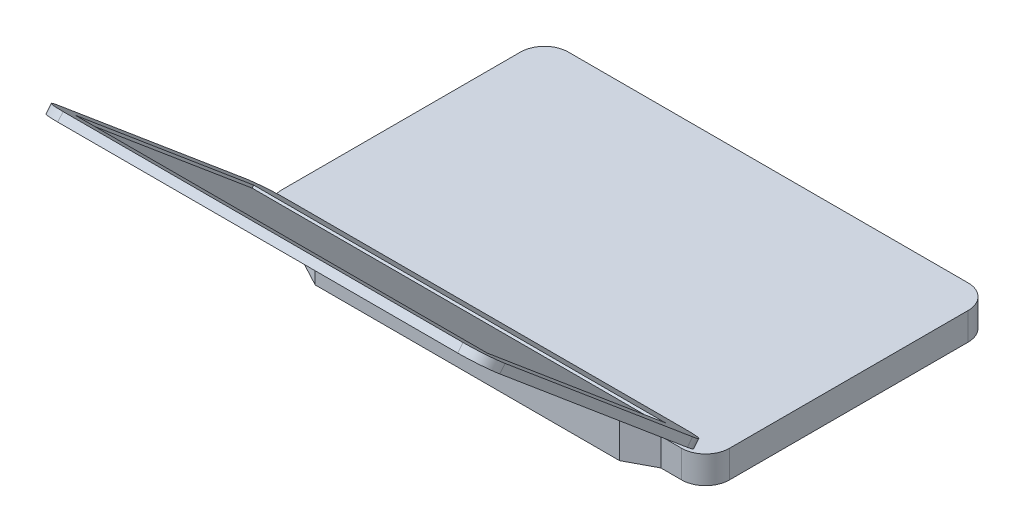
ISO-10303-21;
HEADER;
FILE_DESCRIPTION(('STEP AP214'),'2;1');
FILE_NAME('part.step','',(''),(''),'','','');
FILE_SCHEMA(('AUTOMOTIVE_DESIGN { 1 0 10303 214 1 1 1 1 }'));
ENDSEC;
DATA;
#1=APPLICATION_CONTEXT('core data for automotive mechanical design processes');
#2=APPLICATION_PROTOCOL_DEFINITION('international standard','automotive_design',2000,#1);
#3=PRODUCT_CONTEXT('',#1,'mechanical');
#4=PRODUCT('Part','Part','',(#3));
#5=PRODUCT_RELATED_PRODUCT_CATEGORY('part','',(#4));
#6=PRODUCT_DEFINITION_FORMATION('','',#4);
#7=PRODUCT_DEFINITION_CONTEXT('part definition',#1,'design');
#8=PRODUCT_DEFINITION('design','',#6,#7);
#9=PRODUCT_DEFINITION_SHAPE('','',#8);
#10=(LENGTH_UNIT() NAMED_UNIT(*) SI_UNIT(.MILLI.,.METRE.));
#11=(NAMED_UNIT(*) PLANE_ANGLE_UNIT() SI_UNIT($,.RADIAN.));
#12=(NAMED_UNIT(*) SI_UNIT($,.STERADIAN.) SOLID_ANGLE_UNIT());
#13=UNCERTAINTY_MEASURE_WITH_UNIT(LENGTH_MEASURE(1.E-05),#10,'distance_accuracy_value','');
#14=(GEOMETRIC_REPRESENTATION_CONTEXT(3) GLOBAL_UNCERTAINTY_ASSIGNED_CONTEXT((#13)) GLOBAL_UNIT_ASSIGNED_CONTEXT((#10,
#11,#12)) REPRESENTATION_CONTEXT('',''));
#15=CARTESIAN_POINT('',(0.,0.,0.));
#16=DIRECTION('',(0.,0.,1.));
#17=DIRECTION('',(1.,0.,0.));
#18=AXIS2_PLACEMENT_3D('',#15,#16,#17);
#19=CARTESIAN_POINT('',(187.5,23.,120.));
#20=DIRECTION('',(0.,0.,-1.));
#21=DIRECTION('',(-1.,0.,0.));
#22=AXIS2_PLACEMENT_3D('',#19,#20,#21);
#23=PLANE('',#22);
#24=DIRECTION('',(1.,0.,0.));
#25=VECTOR('',#24,1.);
#26=CARTESIAN_POINT('',(187.5,23.,120.));
#27=LINE('',#26,#25);
#28=CARTESIAN_POINT('',(-167.5,23.,120.));
#29=VERTEX_POINT('',#28);
#30=CARTESIAN_POINT('',(-150.,23.,120.));
#31=VERTEX_POINT('',#30);
#32=EDGE_CURVE('E318',#29,#31,#27,.T.);
#33=ORIENTED_EDGE('',*,*,#32,.F.);
#34=DIRECTION('',(0.,-1.,0.));
#35=VECTOR('',#34,1.);
#36=CARTESIAN_POINT('',(-167.5,23.,120.));
#37=LINE('',#36,#35);
#38=CARTESIAN_POINT('',(-167.5,0.,120.));
#39=VERTEX_POINT('',#38);
#40=EDGE_CURVE('E397',#29,#39,#37,.T.);
#41=ORIENTED_EDGE('',*,*,#40,.T.);
#42=DIRECTION('',(1.,0.,0.));
#43=VECTOR('',#42,1.);
#44=CARTESIAN_POINT('',(187.5,0.,120.));
#45=LINE('',#44,#43);
#46=CARTESIAN_POINT('',(-150.,0.,120.));
#47=VERTEX_POINT('',#46);
#48=EDGE_CURVE('E330',#39,#47,#45,.T.);
#49=ORIENTED_EDGE('',*,*,#48,.T.);
#50=DIRECTION('',(0.,-1.,0.));
#51=VECTOR('',#50,1.);
#52=CARTESIAN_POINT('',(-150.,34.,120.));
#53=LINE('',#52,#51);
#54=EDGE_CURVE('E307',#31,#47,#53,.T.);
#55=ORIENTED_EDGE('',*,*,#54,.F.);
#56=EDGE_LOOP('',(#33,#41,#49,#55));
#57=FACE_BOUND('',#56,.T.);
#58=ADVANCED_FACE('F38',(#57),#23,.F.);
#59=CARTESIAN_POINT('',(-187.5,23.,120.));
#60=DIRECTION('',(1.,0.,0.));
#61=DIRECTION('',(0.,0.,-1.));
#62=AXIS2_PLACEMENT_3D('',#59,#60,#61);
#63=PLANE('',#62);
#64=DIRECTION('',(0.,0.,1.));
#65=VECTOR('',#64,1.);
#66=CARTESIAN_POINT('',(-187.5,23.,120.));
#67=LINE('',#66,#65);
#68=CARTESIAN_POINT('',(-187.5,23.,-100.));
#69=VERTEX_POINT('',#68);
#70=CARTESIAN_POINT('',(-187.5,23.,100.));
#71=VERTEX_POINT('',#70);
#72=EDGE_CURVE('E313',#69,#71,#67,.T.);
#73=ORIENTED_EDGE('',*,*,#72,.F.);
#74=DIRECTION('',(0.,-1.,0.));
#75=VECTOR('',#74,1.);
#76=CARTESIAN_POINT('',(-187.5,23.,-100.));
#77=LINE('',#76,#75);
#78=CARTESIAN_POINT('',(-187.5,0.,-100.));
#79=VERTEX_POINT('',#78);
#80=EDGE_CURVE('E341',#69,#79,#77,.T.);
#81=ORIENTED_EDGE('',*,*,#80,.T.);
#82=DIRECTION('',(0.,0.,1.));
#83=VECTOR('',#82,1.);
#84=CARTESIAN_POINT('',(-187.5,0.,120.));
#85=LINE('',#84,#83);
#86=CARTESIAN_POINT('',(-187.5,0.,100.));
#87=VERTEX_POINT('',#86);
#88=EDGE_CURVE('E305',#79,#87,#85,.T.);
#89=ORIENTED_EDGE('',*,*,#88,.T.);
#90=DIRECTION('',(0.,-1.,0.));
#91=VECTOR('',#90,1.);
#92=CARTESIAN_POINT('',(-187.5,23.,100.));
#93=LINE('',#92,#91);
#94=EDGE_CURVE('E339',#87,#71,#93,.F.);
#95=ORIENTED_EDGE('',*,*,#94,.T.);
#96=EDGE_LOOP('',(#73,#81,#89,#95));
#97=FACE_BOUND('',#96,.T.);
#98=ADVANCED_FACE('F451',(#97),#63,.F.);
#99=CARTESIAN_POINT('',(150.,0.,120.));
#100=VERTEX_POINT('',#99);
#101=CARTESIAN_POINT('',(167.5,0.,120.));
#102=VERTEX_POINT('',#101);
#103=EDGE_CURVE('E329',#100,#102,#45,.T.);
#104=ORIENTED_EDGE('',*,*,#103,.T.);
#105=DIRECTION('',(0.,-1.,0.));
#106=VECTOR('',#105,1.);
#107=CARTESIAN_POINT('',(167.5,23.,120.));
#108=LINE('',#107,#106);
#109=CARTESIAN_POINT('',(167.5,23.,120.));
#110=VERTEX_POINT('',#109);
#111=EDGE_CURVE('E370',#102,#110,#108,.F.);
#112=ORIENTED_EDGE('',*,*,#111,.T.);
#113=CARTESIAN_POINT('',(150.,23.,120.));
#114=VERTEX_POINT('',#113);
#115=EDGE_CURVE('E316',#114,#110,#27,.T.);
#116=ORIENTED_EDGE('',*,*,#115,.F.);
#117=DIRECTION('',(0.,-1.,0.));
#118=VECTOR('',#117,1.);
#119=CARTESIAN_POINT('',(150.,34.,120.));
#120=LINE('',#119,#118);
#121=EDGE_CURVE('E312',#114,#100,#120,.T.);
#122=ORIENTED_EDGE('',*,*,#121,.T.);
#123=EDGE_LOOP('',(#104,#112,#116,#122));
#124=FACE_BOUND('',#123,.T.);
#125=ADVANCED_FACE('F454',(#124),#23,.F.);
#126=CARTESIAN_POINT('',(187.5,23.,120.));
#127=DIRECTION('',(-1.,0.,0.));
#128=DIRECTION('',(0.,0.,1.));
#129=AXIS2_PLACEMENT_3D('',#126,#127,#128);
#130=PLANE('',#129);
#131=DIRECTION('',(0.,0.,-1.));
#132=VECTOR('',#131,1.);
#133=CARTESIAN_POINT('',(187.5,0.,120.));
#134=LINE('',#133,#132);
#135=CARTESIAN_POINT('',(187.5,0.,99.9999999999999));
#136=VERTEX_POINT('',#135);
#137=CARTESIAN_POINT('',(187.5,0.,-100.));
#138=VERTEX_POINT('',#137);
#139=EDGE_CURVE('E332',#136,#138,#134,.T.);
#140=ORIENTED_EDGE('',*,*,#139,.T.);
#141=DIRECTION('',(0.,-1.,0.));
#142=VECTOR('',#141,1.);
#143=CARTESIAN_POINT('',(187.5,23.,-100.));
#144=LINE('',#143,#142);
#145=CARTESIAN_POINT('',(187.5,23.,-100.));
#146=VERTEX_POINT('',#145);
#147=EDGE_CURVE('E368',#138,#146,#144,.F.);
#148=ORIENTED_EDGE('',*,*,#147,.T.);
#149=DIRECTION('',(0.,0.,-1.));
#150=VECTOR('',#149,1.);
#151=CARTESIAN_POINT('',(187.5,23.,120.));
#152=LINE('',#151,#150);
#153=CARTESIAN_POINT('',(187.5,23.,99.9999999999999));
#154=VERTEX_POINT('',#153);
#155=EDGE_CURVE('E320',#154,#146,#152,.T.);
#156=ORIENTED_EDGE('',*,*,#155,.F.);
#157=DIRECTION('',(0.,-1.,0.));
#158=VECTOR('',#157,1.);
#159=CARTESIAN_POINT('',(187.5,23.,99.9999999999999));
#160=LINE('',#159,#158);
#161=EDGE_CURVE('E365',#154,#136,#160,.T.);
#162=ORIENTED_EDGE('',*,*,#161,.T.);
#163=EDGE_LOOP('',(#140,#148,#156,#162));
#164=FACE_BOUND('',#163,.T.);
#165=ADVANCED_FACE('F463',(#164),#130,.F.);
#166=CARTESIAN_POINT('',(187.5,23.,-120.));
#167=DIRECTION('',(0.,0.,1.));
#168=DIRECTION('',(1.,0.,0.));
#169=AXIS2_PLACEMENT_3D('',#166,#167,#168);
#170=PLANE('',#169);
#171=DIRECTION('',(-1.,0.,0.));
#172=VECTOR('',#171,1.);
#173=CARTESIAN_POINT('',(187.5,0.,-120.));
#174=LINE('',#173,#172);
#175=CARTESIAN_POINT('',(167.5,0.,-120.));
#176=VERTEX_POINT('',#175);
#177=CARTESIAN_POINT('',(-167.5,0.,-120.));
#178=VERTEX_POINT('',#177);
#179=EDGE_CURVE('E317',#176,#178,#174,.T.);
#180=ORIENTED_EDGE('',*,*,#179,.T.);
#181=DIRECTION('',(0.,-1.,0.));
#182=VECTOR('',#181,1.);
#183=CARTESIAN_POINT('',(-167.5,23.,-120.));
#184=LINE('',#183,#182);
#185=CARTESIAN_POINT('',(-167.5,23.,-120.));
#186=VERTEX_POINT('',#185);
#187=EDGE_CURVE('E355',#178,#186,#184,.F.);
#188=ORIENTED_EDGE('',*,*,#187,.T.);
#189=DIRECTION('',(-1.,0.,0.));
#190=VECTOR('',#189,1.);
#191=CARTESIAN_POINT('',(187.5,23.,-120.));
#192=LINE('',#191,#190);
#193=CARTESIAN_POINT('',(167.5,23.,-120.));
#194=VERTEX_POINT('',#193);
#195=EDGE_CURVE('E324',#194,#186,#192,.T.);
#196=ORIENTED_EDGE('',*,*,#195,.F.);
#197=DIRECTION('',(0.,-1.,0.));
#198=VECTOR('',#197,1.);
#199=CARTESIAN_POINT('',(167.5,23.,-120.));
#200=LINE('',#199,#198);
#201=EDGE_CURVE('E352',#194,#176,#200,.T.);
#202=ORIENTED_EDGE('',*,*,#201,.T.);
#203=EDGE_LOOP('',(#180,#188,#196,#202));
#204=FACE_BOUND('',#203,.T.);
#205=ADVANCED_FACE('F468',(#204),#170,.F.);
#206=CARTESIAN_POINT('',(0.,23.,0.));
#207=DIRECTION('',(0.,1.,0.));
#208=DIRECTION('',(0.,0.,1.));
#209=AXIS2_PLACEMENT_3D('',#206,#207,#208);
#210=PLANE('',#209);
#211=ORIENTED_EDGE('',*,*,#195,.T.);
#212=CARTESIAN_POINT('',(-167.5,23.,-100.));
#213=DIRECTION('',(0.,1.,0.));
#214=DIRECTION('',(0.,0.,1.));
#215=AXIS2_PLACEMENT_3D('',#212,#213,#214);
#216=CIRCLE('',#215,20.);
#217=EDGE_CURVE('E363',#186,#69,#216,.T.);
#218=ORIENTED_EDGE('',*,*,#217,.T.);
#219=ORIENTED_EDGE('',*,*,#72,.T.);
#220=CARTESIAN_POINT('',(-167.5,23.,100.));
#221=DIRECTION('',(0.,1.,0.));
#222=DIRECTION('',(0.,0.,1.));
#223=AXIS2_PLACEMENT_3D('',#220,#221,#222);
#224=CIRCLE('',#223,20.);
#225=EDGE_CURVE('E357',#71,#29,#224,.T.);
#226=ORIENTED_EDGE('',*,*,#225,.T.);
#227=ORIENTED_EDGE('',*,*,#32,.T.);
#228=EDGE_CURVE('E321',#31,#114,#27,.T.);
#229=ORIENTED_EDGE('',*,*,#228,.T.);
#230=ORIENTED_EDGE('',*,*,#115,.T.);
#231=CARTESIAN_POINT('',(167.5,23.,99.9999999999999));
#232=DIRECTION('',(0.,1.,0.));
#233=DIRECTION('',(0.,0.,1.));
#234=AXIS2_PLACEMENT_3D('',#231,#232,#233);
#235=CIRCLE('',#234,20.);
#236=EDGE_CURVE('E359',#110,#154,#235,.T.);
#237=ORIENTED_EDGE('',*,*,#236,.T.);
#238=ORIENTED_EDGE('',*,*,#155,.T.);
#239=CARTESIAN_POINT('',(167.5,23.,-100.));
#240=DIRECTION('',(0.,1.,0.));
#241=DIRECTION('',(0.,0.,1.));
#242=AXIS2_PLACEMENT_3D('',#239,#240,#241);
#243=CIRCLE('',#242,20.);
#244=EDGE_CURVE('E361',#146,#194,#243,.T.);
#245=ORIENTED_EDGE('',*,*,#244,.T.);
#246=EDGE_LOOP('',(#211,#218,#219,#226,#227,#229,#230,#237,#238,#245));
#247=FACE_BOUND('',#246,.T.);
#248=ADVANCED_FACE('F484',(#247),#210,.T.);
#249=CARTESIAN_POINT('',(0.,0.,0.));
#250=DIRECTION('',(0.,1.,0.));
#251=DIRECTION('',(0.,0.,1.));
#252=AXIS2_PLACEMENT_3D('',#249,#250,#251);
#253=PLANE('',#252);
#254=ORIENTED_EDGE('',*,*,#88,.F.);
#255=CARTESIAN_POINT('',(-167.5,0.,-100.));
#256=DIRECTION('',(0.,1.,0.));
#257=DIRECTION('',(0.,0.,1.));
#258=AXIS2_PLACEMENT_3D('',#255,#256,#257);
#259=CIRCLE('',#258,20.);
#260=EDGE_CURVE('E350',#79,#178,#259,.F.);
#261=ORIENTED_EDGE('',*,*,#260,.T.);
#262=ORIENTED_EDGE('',*,*,#179,.F.);
#263=CARTESIAN_POINT('',(167.5,0.,-100.));
#264=DIRECTION('',(0.,1.,0.));
#265=DIRECTION('',(0.,0.,1.));
#266=AXIS2_PLACEMENT_3D('',#263,#264,#265);
#267=CIRCLE('',#266,20.);
#268=EDGE_CURVE('E348',#176,#138,#267,.F.);
#269=ORIENTED_EDGE('',*,*,#268,.T.);
#270=ORIENTED_EDGE('',*,*,#139,.F.);
#271=CARTESIAN_POINT('',(167.5,0.,99.9999999999999));
#272=DIRECTION('',(0.,1.,0.));
#273=DIRECTION('',(0.,0.,1.));
#274=AXIS2_PLACEMENT_3D('',#271,#272,#273);
#275=CIRCLE('',#274,20.);
#276=EDGE_CURVE('E346',#136,#102,#275,.F.);
#277=ORIENTED_EDGE('',*,*,#276,.T.);
#278=ORIENTED_EDGE('',*,*,#103,.F.);
#279=DIRECTION('',(-0.88235294117647,0.,0.470588235294118));
#280=VECTOR('',#279,1.);
#281=CARTESIAN_POINT('',(150.,0.,120.));
#282=LINE('',#281,#280);
#283=CARTESIAN_POINT('',(127.5,0.,132.));
#284=VERTEX_POINT('',#283);
#285=EDGE_CURVE('E284',#100,#284,#282,.T.);
#286=ORIENTED_EDGE('',*,*,#285,.T.);
#287=DIRECTION('',(-1.,0.,0.));
#288=VECTOR('',#287,1.);
#289=CARTESIAN_POINT('',(-127.5,0.,132.));
#290=LINE('',#289,#288);
#291=CARTESIAN_POINT('',(-127.5,0.,132.));
#292=VERTEX_POINT('',#291);
#293=EDGE_CURVE('E297',#284,#292,#290,.T.);
#294=ORIENTED_EDGE('',*,*,#293,.T.);
#295=DIRECTION('',(-0.88235294117647,0.,-0.470588235294118));
#296=VECTOR('',#295,1.);
#297=CARTESIAN_POINT('',(-150.,0.,120.));
#298=LINE('',#297,#296);
#299=EDGE_CURVE('E288',#292,#47,#298,.T.);
#300=ORIENTED_EDGE('',*,*,#299,.T.);
#301=ORIENTED_EDGE('',*,*,#48,.F.);
#302=CARTESIAN_POINT('',(-167.5,0.,100.));
#303=DIRECTION('',(0.,1.,0.));
#304=DIRECTION('',(0.,0.,1.));
#305=AXIS2_PLACEMENT_3D('',#302,#303,#304);
#306=CIRCLE('',#305,20.);
#307=EDGE_CURVE('E344',#39,#87,#306,.F.);
#308=ORIENTED_EDGE('',*,*,#307,.T.);
#309=EDGE_LOOP('',(#254,#261,#262,#269,#270,#277,#278,#286,#294,#300,#301,#308));
#310=FACE_BOUND('',#309,.T.);
#311=ADVANCED_FACE('F513',(#310),#253,.F.);
#312=CARTESIAN_POINT('',(-150.,34.,120.));
#313=DIRECTION('',(0.,0.,-1.));
#314=DIRECTION('',(-1.,0.,0.));
#315=AXIS2_PLACEMENT_3D('',#312,#313,#314);
#316=PLANE('',#315);
#317=DIRECTION('',(-1.,0.,0.));
#318=VECTOR('',#317,1.);
#319=CARTESIAN_POINT('',(187.5,28.5,120.));
#320=LINE('',#319,#318);
#321=CARTESIAN_POINT('',(150.,28.5,120.));
#322=VERTEX_POINT('',#321);
#323=CARTESIAN_POINT('',(-150.,28.5,120.));
#324=VERTEX_POINT('',#323);
#325=EDGE_CURVE('E266',#322,#324,#320,.T.);
#326=ORIENTED_EDGE('',*,*,#325,.F.);
#327=EDGE_CURVE('E294',#322,#114,#120,.T.);
#328=ORIENTED_EDGE('',*,*,#327,.T.);
#329=ORIENTED_EDGE('',*,*,#228,.F.);
#330=EDGE_CURVE('E302',#324,#31,#53,.T.);
#331=ORIENTED_EDGE('',*,*,#330,.F.);
#332=EDGE_LOOP('',(#326,#328,#329,#331));
#333=FACE_BOUND('',#332,.T.);
#334=ADVANCED_FACE('F524',(#333),#316,.T.);
#335=CARTESIAN_POINT('',(-150.,34.,120.));
#336=DIRECTION('',(-0.470588235294118,0.,0.88235294117647));
#337=DIRECTION('',(0.88235294117647,0.,0.470588235294118));
#338=AXIS2_PLACEMENT_3D('',#335,#336,#337);
#339=PLANE('',#338);
#340=DIRECTION('',(0.820687751717358,0.367274021214799,0.437700134249258));
#341=VECTOR('',#340,1.);
#342=CARTESIAN_POINT('',(-148.342204900958,29.2418961366261,120.884157386156));
#343=LINE('',#342,#341);
#344=CARTESIAN_POINT('',(-137.710041076372,34.,126.554644759268));
#345=VERTEX_POINT('',#344);
#346=EDGE_CURVE('E281',#324,#345,#343,.T.);
#347=ORIENTED_EDGE('',*,*,#346,.F.);
#348=ORIENTED_EDGE('',*,*,#330,.T.);
#349=ORIENTED_EDGE('',*,*,#54,.T.);
#350=ORIENTED_EDGE('',*,*,#299,.F.);
#351=DIRECTION('',(0.,-1.,0.));
#352=VECTOR('',#351,1.);
#353=CARTESIAN_POINT('',(-127.5,34.,132.));
#354=LINE('',#353,#352);
#355=CARTESIAN_POINT('',(-127.5,34.,132.));
#356=VERTEX_POINT('',#355);
#357=EDGE_CURVE('E306',#356,#292,#354,.T.);
#358=ORIENTED_EDGE('',*,*,#357,.F.);
#359=DIRECTION('',(-0.88235294117647,0.,-0.470588235294118));
#360=VECTOR('',#359,1.);
#361=CARTESIAN_POINT('',(-150.,34.,120.));
#362=LINE('',#361,#360);
#363=EDGE_CURVE('E291',#356,#345,#362,.T.);
#364=ORIENTED_EDGE('',*,*,#363,.T.);
#365=EDGE_LOOP('',(#347,#348,#349,#350,#358,#364));
#366=FACE_BOUND('',#365,.T.);
#367=ADVANCED_FACE('F511',(#366),#339,.T.);
#368=CARTESIAN_POINT('',(-127.5,34.,132.));
#369=DIRECTION('',(0.,0.,1.));
#370=DIRECTION('',(1.,0.,0.));
#371=AXIS2_PLACEMENT_3D('',#368,#369,#370);
#372=PLANE('',#371);
#373=ORIENTED_EDGE('',*,*,#293,.F.);
#374=DIRECTION('',(0.,-1.,0.));
#375=VECTOR('',#374,1.);
#376=CARTESIAN_POINT('',(127.5,34.,132.));
#377=LINE('',#376,#375);
#378=CARTESIAN_POINT('',(127.5,34.,132.));
#379=VERTEX_POINT('',#378);
#380=EDGE_CURVE('E309',#379,#284,#377,.T.);
#381=ORIENTED_EDGE('',*,*,#380,.F.);
#382=DIRECTION('',(-1.,0.,0.));
#383=VECTOR('',#382,1.);
#384=CARTESIAN_POINT('',(-127.5,34.,132.));
#385=LINE('',#384,#383);
#386=EDGE_CURVE('E287',#379,#356,#385,.T.);
#387=ORIENTED_EDGE('',*,*,#386,.T.);
#388=ORIENTED_EDGE('',*,*,#357,.T.);
#389=EDGE_LOOP('',(#373,#381,#387,#388));
#390=FACE_BOUND('',#389,.T.);
#391=ADVANCED_FACE('F517',(#390),#372,.T.);
#392=CARTESIAN_POINT('',(150.,34.,120.));
#393=DIRECTION('',(0.470588235294118,0.,0.882352941176471));
#394=DIRECTION('',(0.882352941176471,0.,-0.470588235294118));
#395=AXIS2_PLACEMENT_3D('',#392,#393,#394);
#396=PLANE('',#395);
#397=DIRECTION('',(0.820687751717359,-0.367274021214799,-0.437700134249258));
#398=VECTOR('',#397,1.);
#399=CARTESIAN_POINT('',(148.342204900958,29.2418961366261,120.884157386156));
#400=LINE('',#399,#398);
#401=CARTESIAN_POINT('',(137.710041076372,34.,126.554644759268));
#402=VERTEX_POINT('',#401);
#403=EDGE_CURVE('E278',#402,#322,#400,.T.);
#404=ORIENTED_EDGE('',*,*,#403,.F.);
#405=DIRECTION('',(-0.88235294117647,0.,0.470588235294118));
#406=VECTOR('',#405,1.);
#407=CARTESIAN_POINT('',(150.,34.,120.));
#408=LINE('',#407,#406);
#409=EDGE_CURVE('E285',#402,#379,#408,.T.);
#410=ORIENTED_EDGE('',*,*,#409,.T.);
#411=ORIENTED_EDGE('',*,*,#380,.T.);
#412=ORIENTED_EDGE('',*,*,#285,.F.);
#413=ORIENTED_EDGE('',*,*,#121,.F.);
#414=ORIENTED_EDGE('',*,*,#327,.F.);
#415=EDGE_LOOP('',(#404,#410,#411,#412,#413,#414));
#416=FACE_BOUND('',#415,.T.);
#417=ADVANCED_FACE('F526',(#416),#396,.T.);
#418=CARTESIAN_POINT('',(0.,34.,0.));
#419=DIRECTION('',(0.,-1.,0.));
#420=DIRECTION('',(0.,0.,-1.));
#421=AXIS2_PLACEMENT_3D('',#418,#419,#420);
#422=PLANE('',#421);
#423=ORIENTED_EDGE('',*,*,#409,.F.);
#424=DIRECTION('',(-1.,0.,0.));
#425=VECTOR('',#424,1.);
#426=CARTESIAN_POINT('',(0.,34.,126.554644759268));
#427=LINE('',#426,#425);
#428=EDGE_CURVE('E337',#402,#345,#427,.T.);
#429=ORIENTED_EDGE('',*,*,#428,.T.);
#430=ORIENTED_EDGE('',*,*,#363,.F.);
#431=ORIENTED_EDGE('',*,*,#386,.F.);
#432=EDGE_LOOP('',(#423,#429,#430,#431));
#433=FACE_BOUND('',#432,.T.);
#434=ADVANCED_FACE('F528',(#433),#422,.F.);
#435=CARTESIAN_POINT('',(187.5,191.345275475035,303.181375296344));
#436=DIRECTION('',(-1.,0.,0.));
#437=DIRECTION('',(0.,0.,1.));
#438=AXIS2_PLACEMENT_3D('',#435,#436,#437);
#439=PLANE('',#438);
#440=DIRECTION('',(0.,-0.64278760968654,-0.766044443118977));
#441=VECTOR('',#440,1.);
#442=CARTESIAN_POINT('',(187.5,185.982964373202,307.680888564149));
#443=LINE('',#442,#441);
#444=CARTESIAN_POINT('',(187.5,173.127212179471,292.35999970177));
#445=VERTEX_POINT('',#444);
#446=CARTESIAN_POINT('',(187.5,41.3557521937308,135.32088886238));
#447=VERTEX_POINT('',#446);
#448=EDGE_CURVE('E251',#445,#447,#443,.T.);
#449=ORIENTED_EDGE('',*,*,#448,.T.);
#450=DIRECTION('',(0.,-0.766044443118977,0.64278760968654));
#451=VECTOR('',#450,1.);
#452=CARTESIAN_POINT('',(187.5,46.7180632955637,130.821375594574));
#453=LINE('',#452,#451);
#454=CARTESIAN_POINT('',(187.5,46.7180632955637,130.821375594574));
#455=VERTEX_POINT('',#454);
#456=EDGE_CURVE('E388',#447,#455,#453,.F.);
#457=ORIENTED_EDGE('',*,*,#456,.T.);
#458=DIRECTION('',(0.,-0.64278760968654,-0.766044443118977));
#459=VECTOR('',#458,1.);
#460=CARTESIAN_POINT('',(187.5,191.345275475035,303.181375296344));
#461=LINE('',#460,#459);
#462=CARTESIAN_POINT('',(187.5,178.489523281304,287.860486433964));
#463=VERTEX_POINT('',#462);
#464=EDGE_CURVE('E255',#463,#455,#461,.T.);
#465=ORIENTED_EDGE('',*,*,#464,.F.);
#466=DIRECTION('',(0.,-0.766044443118977,0.64278760968654));
#467=VECTOR('',#466,1.);
#468=CARTESIAN_POINT('',(187.5,178.489523281304,287.860486433964));
#469=LINE('',#468,#467);
#470=EDGE_CURVE('E385',#463,#445,#469,.T.);
#471=ORIENTED_EDGE('',*,*,#470,.T.);
#472=EDGE_LOOP('',(#449,#457,#465,#471));
#473=FACE_BOUND('',#472,.T.);
#474=ADVANCED_FACE('F429',(#473),#439,.F.);
#475=CARTESIAN_POINT('',(-187.5,33.8623111018328,115.500486732194));
#476=DIRECTION('',(0.,0.64278760968654,0.766044443118977));
#477=DIRECTION('',(0.,-0.766044443118977,0.64278760968654));
#478=AXIS2_PLACEMENT_3D('',#475,#476,#477);
#479=PLANE('',#478);
#480=DIRECTION('',(-1.,0.,0.));
#481=VECTOR('',#480,1.);
#482=CARTESIAN_POINT('',(-187.5,33.8623111018328,115.500486732194));
#483=LINE('',#482,#481);
#484=CARTESIAN_POINT('',(167.5,33.8623111018328,115.500486732194));
#485=VERTEX_POINT('',#484);
#486=CARTESIAN_POINT('',(-167.5,33.8623111018328,115.500486732194));
#487=VERTEX_POINT('',#486);
#488=EDGE_CURVE('E258',#485,#487,#483,.T.);
#489=ORIENTED_EDGE('',*,*,#488,.F.);
#490=DIRECTION('',(0.,-0.766044443118977,0.64278760968654));
#491=VECTOR('',#490,1.);
#492=CARTESIAN_POINT('',(167.5,33.8623111018328,115.500486732194));
#493=LINE('',#492,#491);
#494=CARTESIAN_POINT('',(167.5,28.5,120.));
#495=VERTEX_POINT('',#494);
#496=EDGE_CURVE('E374',#485,#495,#493,.T.);
#497=ORIENTED_EDGE('',*,*,#496,.T.);
#498=DIRECTION('',(-1.,0.,0.));
#499=VECTOR('',#498,1.);
#500=CARTESIAN_POINT('',(-187.5,28.5,120.));
#501=LINE('',#500,#499);
#502=EDGE_CURVE('E270',#495,#322,#501,.T.);
#503=ORIENTED_EDGE('',*,*,#502,.T.);
#504=ORIENTED_EDGE('',*,*,#325,.T.);
#505=CARTESIAN_POINT('',(-167.5,28.5,120.));
#506=VERTEX_POINT('',#505);
#507=EDGE_CURVE('E269',#324,#506,#501,.T.);
#508=ORIENTED_EDGE('',*,*,#507,.T.);
#509=DIRECTION('',(0.,-0.766044443118977,0.64278760968654));
#510=VECTOR('',#509,1.);
#511=CARTESIAN_POINT('',(-167.5,33.8623111018328,115.500486732194));
#512=LINE('',#511,#510);
#513=EDGE_CURVE('E372',#506,#487,#512,.F.);
#514=ORIENTED_EDGE('',*,*,#513,.T.);
#515=EDGE_LOOP('',(#489,#497,#503,#504,#508,#514));
#516=FACE_BOUND('',#515,.T.);
#517=ADVANCED_FACE('F437',(#516),#479,.F.);
#518=CARTESIAN_POINT('',(-187.5,191.345275475035,303.181375296344));
#519=DIRECTION('',(1.,0.,0.));
#520=DIRECTION('',(0.,0.,-1.));
#521=AXIS2_PLACEMENT_3D('',#518,#519,#520);
#522=PLANE('',#521);
#523=DIRECTION('',(0.,0.64278760968654,0.766044443118977));
#524=VECTOR('',#523,1.);
#525=CARTESIAN_POINT('',(-187.5,191.345275475035,303.181375296344));
#526=LINE('',#525,#524);
#527=CARTESIAN_POINT('',(-187.5,46.7180632955637,130.821375594574));
#528=VERTEX_POINT('',#527);
#529=CARTESIAN_POINT('',(-187.5,178.489523281304,287.860486433964));
#530=VERTEX_POINT('',#529);
#531=EDGE_CURVE('E262',#528,#530,#526,.T.);
#532=ORIENTED_EDGE('',*,*,#531,.F.);
#533=DIRECTION('',(0.,-0.766044443118977,0.64278760968654));
#534=VECTOR('',#533,1.);
#535=CARTESIAN_POINT('',(-187.5,46.7180632955637,130.821375594574));
#536=LINE('',#535,#534);
#537=CARTESIAN_POINT('',(-187.5,41.3557521937308,135.32088886238));
#538=VERTEX_POINT('',#537);
#539=EDGE_CURVE('E402',#528,#538,#536,.T.);
#540=ORIENTED_EDGE('',*,*,#539,.T.);
#541=DIRECTION('',(0.,0.64278760968654,0.766044443118977));
#542=VECTOR('',#541,1.);
#543=CARTESIAN_POINT('',(-187.5,185.982964373202,307.680888564149));
#544=LINE('',#543,#542);
#545=CARTESIAN_POINT('',(-187.5,173.127212179472,292.35999970177));
#546=VERTEX_POINT('',#545);
#547=EDGE_CURVE('E272',#538,#546,#544,.T.);
#548=ORIENTED_EDGE('',*,*,#547,.T.);
#549=DIRECTION('',(0.,-0.766044443118977,0.64278760968654));
#550=VECTOR('',#549,1.);
#551=CARTESIAN_POINT('',(-187.5,178.489523281304,287.860486433964));
#552=LINE('',#551,#550);
#553=EDGE_CURVE('E400',#546,#530,#552,.F.);
#554=ORIENTED_EDGE('',*,*,#553,.T.);
#555=EDGE_LOOP('',(#532,#540,#548,#554));
#556=FACE_BOUND('',#555,.T.);
#557=ADVANCED_FACE('F408',(#556),#522,.F.);
#558=CARTESIAN_POINT('',(-187.5,191.345275475035,303.181375296344));
#559=DIRECTION('',(0.,-0.64278760968654,-0.766044443118977));
#560=DIRECTION('',(0.,0.766044443118977,-0.64278760968654));
#561=AXIS2_PLACEMENT_3D('',#558,#559,#560);
#562=PLANE('',#561);
#563=DIRECTION('',(1.,0.,0.));
#564=VECTOR('',#563,1.);
#565=CARTESIAN_POINT('',(-187.5,191.345275475035,303.181375296344));
#566=LINE('',#565,#564);
#567=CARTESIAN_POINT('',(-167.5,191.345275475035,303.181375296344));
#568=VERTEX_POINT('',#567);
#569=CARTESIAN_POINT('',(167.5,191.345275475035,303.181375296344));
#570=VERTEX_POINT('',#569);
#571=EDGE_CURVE('E264',#568,#570,#566,.T.);
#572=ORIENTED_EDGE('',*,*,#571,.F.);
#573=DIRECTION('',(0.,-0.766044443118977,0.64278760968654));
#574=VECTOR('',#573,1.);
#575=CARTESIAN_POINT('',(-167.5,191.345275475035,303.181375296344));
#576=LINE('',#575,#574);
#577=CARTESIAN_POINT('',(-167.5,185.982964373202,307.680888564149));
#578=VERTEX_POINT('',#577);
#579=EDGE_CURVE('E11',#568,#578,#576,.T.);
#580=ORIENTED_EDGE('',*,*,#579,.T.);
#581=DIRECTION('',(1.,0.,0.));
#582=VECTOR('',#581,1.);
#583=CARTESIAN_POINT('',(-187.5,185.982964373202,307.680888564149));
#584=LINE('',#583,#582);
#585=CARTESIAN_POINT('',(167.5,185.982964373202,307.680888564149));
#586=VERTEX_POINT('',#585);
#587=EDGE_CURVE('E259',#578,#586,#584,.T.);
#588=ORIENTED_EDGE('',*,*,#587,.T.);
#589=DIRECTION('',(0.,-0.766044443118977,0.64278760968654));
#590=VECTOR('',#589,1.);
#591=CARTESIAN_POINT('',(167.5,191.345275475035,303.181375296344));
#592=LINE('',#591,#590);
#593=EDGE_CURVE('E46',#586,#570,#592,.F.);
#594=ORIENTED_EDGE('',*,*,#593,.T.);
#595=EDGE_LOOP('',(#572,#580,#588,#594));
#596=FACE_BOUND('',#595,.T.);
#597=ADVANCED_FACE('F421',(#596),#562,.F.);
#598=CARTESIAN_POINT('',(0.,-37.0016675471459,31.0480855917545));
#599=DIRECTION('',(0.,-0.766044443118977,0.64278760968654));
#600=DIRECTION('',(0.,-0.64278760968654,-0.766044443118977));
#601=AXIS2_PLACEMENT_3D('',#598,#599,#600);
#602=PLANE('',#601);
#603=DIRECTION('',(-1.,0.,0.));
#604=VECTOR('',#603,1.);
#605=CARTESIAN_POINT('',(-172.5,53.145939392429,138.481820025764));
#606=LINE('',#605,#604);
#607=CARTESIAN_POINT('',(172.5,53.1459393924291,138.481820025764));
#608=VERTEX_POINT('',#607);
#609=CARTESIAN_POINT('',(-172.5,53.145939392429,138.481820025764));
#610=VERTEX_POINT('',#609);
#611=EDGE_CURVE('E245',#608,#610,#606,.T.);
#612=ORIENTED_EDGE('',*,*,#611,.F.);
#613=DIRECTION('',(0.,-0.64278760968654,-0.766044443118977));
#614=VECTOR('',#613,1.);
#615=CARTESIAN_POINT('',(172.5,53.145939392429,138.481820025764));
#616=LINE('',#615,#614);
#617=CARTESIAN_POINT('',(172.5,178.489523281304,287.860486433964));
#618=VERTEX_POINT('',#617);
#619=EDGE_CURVE('E219',#618,#608,#616,.T.);
#620=ORIENTED_EDGE('',*,*,#619,.F.);
#621=DIRECTION('',(1.,0.,0.));
#622=VECTOR('',#621,1.);
#623=CARTESIAN_POINT('',(-172.5,178.489523281304,287.860486433964));
#624=LINE('',#623,#622);
#625=CARTESIAN_POINT('',(-172.5,178.489523281304,287.860486433964));
#626=VERTEX_POINT('',#625);
#627=EDGE_CURVE('E236',#626,#618,#624,.T.);
#628=ORIENTED_EDGE('',*,*,#627,.F.);
#629=DIRECTION('',(0.,0.64278760968654,0.766044443118977));
#630=VECTOR('',#629,1.);
#631=CARTESIAN_POINT('',(-172.5,53.145939392429,138.481820025764));
#632=LINE('',#631,#630);
#633=EDGE_CURVE('E239',#610,#626,#632,.T.);
#634=ORIENTED_EDGE('',*,*,#633,.F.);
#635=EDGE_LOOP('',(#612,#620,#628,#634));
#636=FACE_BOUND('',#635,.T.);
#637=ORIENTED_EDGE('',*,*,#464,.T.);
#638=CARTESIAN_POINT('',(167.5,46.7180632955636,130.821375594574));
#639=DIRECTION('',(0.,-0.766044443118977,0.64278760968654));
#640=DIRECTION('',(0.,-0.64278760968654,-0.766044443118977));
#641=AXIS2_PLACEMENT_3D('',#638,#639,#640);
#642=CIRCLE('',#641,20.);
#643=EDGE_CURVE('E395',#455,#485,#642,.F.);
#644=ORIENTED_EDGE('',*,*,#643,.T.);
#645=ORIENTED_EDGE('',*,*,#488,.T.);
#646=CARTESIAN_POINT('',(-167.5,46.7180632955636,130.821375594574));
#647=DIRECTION('',(0.,-0.766044443118977,0.64278760968654));
#648=DIRECTION('',(0.,-0.64278760968654,-0.766044443118977));
#649=AXIS2_PLACEMENT_3D('',#646,#647,#648);
#650=CIRCLE('',#649,20.);
#651=EDGE_CURVE('E393',#487,#528,#650,.F.);
#652=ORIENTED_EDGE('',*,*,#651,.T.);
#653=ORIENTED_EDGE('',*,*,#531,.T.);
#654=CARTESIAN_POINT('',(-167.5,178.489523281304,287.860486433964));
#655=DIRECTION('',(0.,-0.766044443118977,0.64278760968654));
#656=DIRECTION('',(0.,-0.64278760968654,-0.766044443118977));
#657=AXIS2_PLACEMENT_3D('',#654,#655,#656);
#658=CIRCLE('',#657,20.);
#659=EDGE_CURVE('E59',#530,#568,#658,.F.);
#660=ORIENTED_EDGE('',*,*,#659,.T.);
#661=ORIENTED_EDGE('',*,*,#571,.T.);
#662=CARTESIAN_POINT('',(167.5,178.489523281304,287.860486433964));
#663=DIRECTION('',(0.,-0.766044443118977,0.64278760968654));
#664=DIRECTION('',(0.,-0.64278760968654,-0.766044443118977));
#665=AXIS2_PLACEMENT_3D('',#662,#663,#664);
#666=CIRCLE('',#665,20.);
#667=EDGE_CURVE('E390',#570,#463,#666,.F.);
#668=ORIENTED_EDGE('',*,*,#667,.T.);
#669=EDGE_LOOP('',(#637,#644,#645,#652,#653,#660,#661,#668));
#670=FACE_BOUND('',#669,.T.);
#671=ADVANCED_FACE('F423',(#636,#670),#602,.F.);
#672=CARTESIAN_POINT('',(0.,-42.3639786489788,35.5475988595603));
#673=DIRECTION('',(0.,-0.766044443118977,0.64278760968654));
#674=DIRECTION('',(0.,-0.64278760968654,-0.766044443118977));
#675=AXIS2_PLACEMENT_3D('',#672,#673,#674);
#676=PLANE('',#675);
#677=ORIENTED_EDGE('',*,*,#502,.F.);
#678=CARTESIAN_POINT('',(167.5,41.3557521937308,135.32088886238));
#679=DIRECTION('',(0.,-0.766044443118977,0.64278760968654));
#680=DIRECTION('',(0.,-0.64278760968654,-0.766044443118977));
#681=AXIS2_PLACEMENT_3D('',#678,#679,#680);
#682=CIRCLE('',#681,20.);
#683=EDGE_CURVE('E383',#495,#447,#682,.T.);
#684=ORIENTED_EDGE('',*,*,#683,.T.);
#685=ORIENTED_EDGE('',*,*,#448,.F.);
#686=CARTESIAN_POINT('',(167.5,173.127212179471,292.35999970177));
#687=DIRECTION('',(0.,-0.766044443118977,0.64278760968654));
#688=DIRECTION('',(0.,-0.64278760968654,-0.766044443118977));
#689=AXIS2_PLACEMENT_3D('',#686,#687,#688);
#690=CIRCLE('',#689,20.);
#691=EDGE_CURVE('E377',#445,#586,#690,.T.);
#692=ORIENTED_EDGE('',*,*,#691,.T.);
#693=ORIENTED_EDGE('',*,*,#587,.F.);
#694=CARTESIAN_POINT('',(-167.5,173.127212179471,292.35999970177));
#695=DIRECTION('',(0.,-0.766044443118977,0.64278760968654));
#696=DIRECTION('',(0.,-0.64278760968654,-0.766044443118977));
#697=AXIS2_PLACEMENT_3D('',#694,#695,#696);
#698=CIRCLE('',#697,20.);
#699=EDGE_CURVE('E379',#578,#546,#698,.T.);
#700=ORIENTED_EDGE('',*,*,#699,.T.);
#701=ORIENTED_EDGE('',*,*,#547,.F.);
#702=CARTESIAN_POINT('',(-167.5,41.3557521937308,135.32088886238));
#703=DIRECTION('',(0.,-0.766044443118977,0.64278760968654));
#704=DIRECTION('',(0.,-0.64278760968654,-0.766044443118977));
#705=AXIS2_PLACEMENT_3D('',#702,#703,#704);
#706=CIRCLE('',#705,20.);
#707=EDGE_CURVE('E381',#538,#506,#706,.T.);
#708=ORIENTED_EDGE('',*,*,#707,.T.);
#709=ORIENTED_EDGE('',*,*,#507,.F.);
#710=ORIENTED_EDGE('',*,*,#346,.T.);
#711=ORIENTED_EDGE('',*,*,#428,.F.);
#712=ORIENTED_EDGE('',*,*,#403,.T.);
#713=EDGE_LOOP('',(#677,#684,#685,#692,#693,#700,#701,#708,#709,#710,#711,#712));
#714=FACE_BOUND('',#713,.T.);
#715=ADVANCED_FACE('F414',(#714),#676,.T.);
#716=CARTESIAN_POINT('',(172.5,51.6138505061911,139.767395245137));
#717=DIRECTION('',(1.,0.,0.));
#718=DIRECTION('',(0.,0.,-1.));
#719=AXIS2_PLACEMENT_3D('',#716,#717,#718);
#720=PLANE('',#719);
#721=ORIENTED_EDGE('',*,*,#619,.T.);
#722=DIRECTION('',(0.,0.766044443118977,-0.64278760968654));
#723=VECTOR('',#722,1.);
#724=CARTESIAN_POINT('',(172.5,51.6138505061911,139.767395245137));
#725=LINE('',#724,#723);
#726=CARTESIAN_POINT('',(172.5,51.6138505061911,139.767395245137));
#727=VERTEX_POINT('',#726);
#728=EDGE_CURVE('E212',#727,#608,#725,.T.);
#729=ORIENTED_EDGE('',*,*,#728,.F.);
#730=DIRECTION('',(0.,-0.64278760968654,-0.766044443118977));
#731=VECTOR('',#730,1.);
#732=CARTESIAN_POINT('',(172.5,51.6138505061911,139.767395245137));
#733=LINE('',#732,#731);
#734=CARTESIAN_POINT('',(172.5,176.957434395066,289.146061653337));
#735=VERTEX_POINT('',#734);
#736=EDGE_CURVE('E216',#735,#727,#733,.T.);
#737=ORIENTED_EDGE('',*,*,#736,.F.);
#738=DIRECTION('',(0.,0.766044443118977,-0.64278760968654));
#739=VECTOR('',#738,1.);
#740=CARTESIAN_POINT('',(172.5,176.957434395066,289.146061653337));
#741=LINE('',#740,#739);
#742=EDGE_CURVE('E249',#735,#618,#741,.T.);
#743=ORIENTED_EDGE('',*,*,#742,.T.);
#744=EDGE_LOOP('',(#721,#729,#737,#743));
#745=FACE_BOUND('',#744,.T.);
#746=ADVANCED_FACE('F214',(#745),#720,.F.);
#747=CARTESIAN_POINT('',(-172.5,176.957434395066,289.146061653337));
#748=DIRECTION('',(0.,0.64278760968654,0.766044443118977));
#749=DIRECTION('',(0.,-0.766044443118977,0.64278760968654));
#750=AXIS2_PLACEMENT_3D('',#747,#748,#749);
#751=PLANE('',#750);
#752=ORIENTED_EDGE('',*,*,#627,.T.);
#753=ORIENTED_EDGE('',*,*,#742,.F.);
#754=DIRECTION('',(1.,0.,0.));
#755=VECTOR('',#754,1.);
#756=CARTESIAN_POINT('',(-172.5,176.957434395066,289.146061653337));
#757=LINE('',#756,#755);
#758=CARTESIAN_POINT('',(-172.5,176.957434395066,289.146061653337));
#759=VERTEX_POINT('',#758);
#760=EDGE_CURVE('E224',#759,#735,#757,.T.);
#761=ORIENTED_EDGE('',*,*,#760,.F.);
#762=DIRECTION('',(0.,0.766044443118977,-0.64278760968654));
#763=VECTOR('',#762,1.);
#764=CARTESIAN_POINT('',(-172.5,176.957434395066,289.146061653337));
#765=LINE('',#764,#763);
#766=EDGE_CURVE('E252',#759,#626,#765,.T.);
#767=ORIENTED_EDGE('',*,*,#766,.T.);
#768=EDGE_LOOP('',(#752,#753,#761,#767));
#769=FACE_BOUND('',#768,.T.);
#770=ADVANCED_FACE('F593',(#769),#751,.F.);
#771=CARTESIAN_POINT('',(-172.5,51.6138505061911,139.767395245137));
#772=DIRECTION('',(-1.,0.,0.));
#773=DIRECTION('',(0.,0.,1.));
#774=AXIS2_PLACEMENT_3D('',#771,#772,#773);
#775=PLANE('',#774);
#776=ORIENTED_EDGE('',*,*,#633,.T.);
#777=ORIENTED_EDGE('',*,*,#766,.F.);
#778=DIRECTION('',(0.,0.64278760968654,0.766044443118977));
#779=VECTOR('',#778,1.);
#780=CARTESIAN_POINT('',(-172.5,51.6138505061911,139.767395245137));
#781=LINE('',#780,#779);
#782=CARTESIAN_POINT('',(-172.5,51.6138505061911,139.767395245137));
#783=VERTEX_POINT('',#782);
#784=EDGE_CURVE('E232',#783,#759,#781,.T.);
#785=ORIENTED_EDGE('',*,*,#784,.F.);
#786=DIRECTION('',(0.,0.766044443118977,-0.64278760968654));
#787=VECTOR('',#786,1.);
#788=CARTESIAN_POINT('',(-172.5,51.6138505061911,139.767395245137));
#789=LINE('',#788,#787);
#790=EDGE_CURVE('E223',#783,#610,#789,.T.);
#791=ORIENTED_EDGE('',*,*,#790,.T.);
#792=EDGE_LOOP('',(#776,#777,#785,#791));
#793=FACE_BOUND('',#792,.T.);
#794=ADVANCED_FACE('F604',(#793),#775,.F.);
#795=CARTESIAN_POINT('',(-172.5,51.6138505061911,139.767395245137));
#796=DIRECTION('',(0.,-0.64278760968654,-0.766044443118977));
#797=DIRECTION('',(0.,0.766044443118977,-0.64278760968654));
#798=AXIS2_PLACEMENT_3D('',#795,#796,#797);
#799=PLANE('',#798);
#800=ORIENTED_EDGE('',*,*,#611,.T.);
#801=ORIENTED_EDGE('',*,*,#790,.F.);
#802=DIRECTION('',(-1.,0.,0.));
#803=VECTOR('',#802,1.);
#804=CARTESIAN_POINT('',(-172.5,51.6138505061911,139.767395245137));
#805=LINE('',#804,#803);
#806=EDGE_CURVE('E227',#727,#783,#805,.T.);
#807=ORIENTED_EDGE('',*,*,#806,.F.);
#808=ORIENTED_EDGE('',*,*,#728,.T.);
#809=EDGE_LOOP('',(#800,#801,#807,#808));
#810=FACE_BOUND('',#809,.T.);
#811=ADVANCED_FACE('F228',(#810),#799,.F.);
#812=CARTESIAN_POINT('',(0.,-38.5337564333839,32.3336608111276));
#813=DIRECTION('',(0.,0.766044443118978,-0.64278760968654));
#814=DIRECTION('',(0.,0.64278760968654,0.766044443118977));
#815=AXIS2_PLACEMENT_3D('',#812,#813,#814);
#816=PLANE('',#815);
#817=ORIENTED_EDGE('',*,*,#736,.T.);
#818=ORIENTED_EDGE('',*,*,#806,.T.);
#819=ORIENTED_EDGE('',*,*,#784,.T.);
#820=ORIENTED_EDGE('',*,*,#760,.T.);
#821=EDGE_LOOP('',(#817,#818,#819,#820));
#822=FACE_BOUND('',#821,.T.);
#823=ADVANCED_FACE('F234',(#822),#816,.T.);
#824=CARTESIAN_POINT('',(-167.5,23.,-100.));
#825=DIRECTION('',(0.,-1.,0.));
#826=DIRECTION('',(0.,0.,-1.));
#827=AXIS2_PLACEMENT_3D('',#824,#825,#826);
#828=CYLINDRICAL_SURFACE('',#827,20.);
#829=ORIENTED_EDGE('',*,*,#217,.F.);
#830=ORIENTED_EDGE('',*,*,#187,.F.);
#831=ORIENTED_EDGE('',*,*,#260,.F.);
#832=ORIENTED_EDGE('',*,*,#80,.F.);
#833=EDGE_LOOP('',(#829,#830,#831,#832));
#834=FACE_BOUND('',#833,.T.);
#835=ADVANCED_FACE('F498',(#834),#828,.T.);
#836=CARTESIAN_POINT('',(167.5,23.,-100.));
#837=DIRECTION('',(0.,-1.,0.));
#838=DIRECTION('',(0.,0.,-1.));
#839=AXIS2_PLACEMENT_3D('',#836,#837,#838);
#840=CYLINDRICAL_SURFACE('',#839,20.);
#841=ORIENTED_EDGE('',*,*,#244,.F.);
#842=ORIENTED_EDGE('',*,*,#147,.F.);
#843=ORIENTED_EDGE('',*,*,#268,.F.);
#844=ORIENTED_EDGE('',*,*,#201,.F.);
#845=EDGE_LOOP('',(#841,#842,#843,#844));
#846=FACE_BOUND('',#845,.T.);
#847=ADVANCED_FACE('F490',(#846),#840,.T.);
#848=CARTESIAN_POINT('',(167.5,23.,99.9999999999999));
#849=DIRECTION('',(0.,-1.,0.));
#850=DIRECTION('',(0.,0.,-1.));
#851=AXIS2_PLACEMENT_3D('',#848,#849,#850);
#852=CYLINDRICAL_SURFACE('',#851,20.);
#853=ORIENTED_EDGE('',*,*,#236,.F.);
#854=ORIENTED_EDGE('',*,*,#111,.F.);
#855=ORIENTED_EDGE('',*,*,#276,.F.);
#856=ORIENTED_EDGE('',*,*,#161,.F.);
#857=EDGE_LOOP('',(#853,#854,#855,#856));
#858=FACE_BOUND('',#857,.T.);
#859=ADVANCED_FACE('F480',(#858),#852,.T.);
#860=CARTESIAN_POINT('',(167.5,46.7180632955636,130.821375594574));
#861=DIRECTION('',(0.,-0.766044443118977,0.64278760968654));
#862=DIRECTION('',(0.,-0.64278760968654,-0.766044443118977));
#863=AXIS2_PLACEMENT_3D('',#860,#861,#862);
#864=CYLINDRICAL_SURFACE('',#863,20.);
#865=ORIENTED_EDGE('',*,*,#643,.F.);
#866=ORIENTED_EDGE('',*,*,#456,.F.);
#867=ORIENTED_EDGE('',*,*,#683,.F.);
#868=ORIENTED_EDGE('',*,*,#496,.F.);
#869=EDGE_LOOP('',(#865,#866,#867,#868));
#870=FACE_BOUND('',#869,.T.);
#871=ADVANCED_FACE('F434',(#870),#864,.T.);
#872=CARTESIAN_POINT('',(-167.5,23.,100.));
#873=DIRECTION('',(0.,-1.,0.));
#874=DIRECTION('',(0.,0.,-1.));
#875=AXIS2_PLACEMENT_3D('',#872,#873,#874);
#876=CYLINDRICAL_SURFACE('',#875,20.);
#877=ORIENTED_EDGE('',*,*,#225,.F.);
#878=ORIENTED_EDGE('',*,*,#94,.F.);
#879=ORIENTED_EDGE('',*,*,#307,.F.);
#880=ORIENTED_EDGE('',*,*,#40,.F.);
#881=EDGE_LOOP('',(#877,#878,#879,#880));
#882=FACE_BOUND('',#881,.T.);
#883=ADVANCED_FACE('F442',(#882),#876,.T.);
#884=CARTESIAN_POINT('',(-167.5,46.7180632955637,130.821375594574));
#885=DIRECTION('',(0.,-0.766044443118977,0.64278760968654));
#886=DIRECTION('',(0.,-0.64278760968654,-0.766044443118977));
#887=AXIS2_PLACEMENT_3D('',#884,#885,#886);
#888=CYLINDRICAL_SURFACE('',#887,20.);
#889=ORIENTED_EDGE('',*,*,#651,.F.);
#890=ORIENTED_EDGE('',*,*,#513,.F.);
#891=ORIENTED_EDGE('',*,*,#707,.F.);
#892=ORIENTED_EDGE('',*,*,#539,.F.);
#893=EDGE_LOOP('',(#889,#890,#891,#892));
#894=FACE_BOUND('',#893,.T.);
#895=ADVANCED_FACE('F440',(#894),#888,.T.);
#896=CARTESIAN_POINT('',(-167.5,178.489523281304,287.860486433964));
#897=DIRECTION('',(0.,-0.766044443118977,0.64278760968654));
#898=DIRECTION('',(0.,-0.64278760968654,-0.766044443118977));
#899=AXIS2_PLACEMENT_3D('',#896,#897,#898);
#900=CYLINDRICAL_SURFACE('',#899,20.);
#901=ORIENTED_EDGE('',*,*,#659,.F.);
#902=ORIENTED_EDGE('',*,*,#553,.F.);
#903=ORIENTED_EDGE('',*,*,#699,.F.);
#904=ORIENTED_EDGE('',*,*,#579,.F.);
#905=EDGE_LOOP('',(#901,#902,#903,#904));
#906=FACE_BOUND('',#905,.T.);
#907=ADVANCED_FACE('F420',(#906),#900,.T.);
#908=CARTESIAN_POINT('',(167.5,178.489523281304,287.860486433964));
#909=DIRECTION('',(0.,-0.766044443118977,0.64278760968654));
#910=DIRECTION('',(0.,-0.64278760968654,-0.766044443118977));
#911=AXIS2_PLACEMENT_3D('',#908,#909,#910);
#912=CYLINDRICAL_SURFACE('',#911,20.);
#913=ORIENTED_EDGE('',*,*,#667,.F.);
#914=ORIENTED_EDGE('',*,*,#593,.F.);
#915=ORIENTED_EDGE('',*,*,#691,.F.);
#916=ORIENTED_EDGE('',*,*,#470,.F.);
#917=EDGE_LOOP('',(#913,#914,#915,#916));
#918=FACE_BOUND('',#917,.T.);
#919=ADVANCED_FACE('F40',(#918),#912,.T.);
#920=CLOSED_SHELL('',(#58,#98,#125,#165,#205,#248,#311,#334,#367,#391,#417,#434,#474,#517,#557,
#597,#671,#715,#746,#770,#794,#811,#823,#835,#847,#859,#871,#883,#895,#907,#919));
#921=MANIFOLD_SOLID_BREP('B2',#920);
#922=ADVANCED_BREP_SHAPE_REPRESENTATION('',(#18,#921),#14);
#923=SHAPE_DEFINITION_REPRESENTATION(#9,#922);
ENDSEC;
END-ISO-10303-21;
